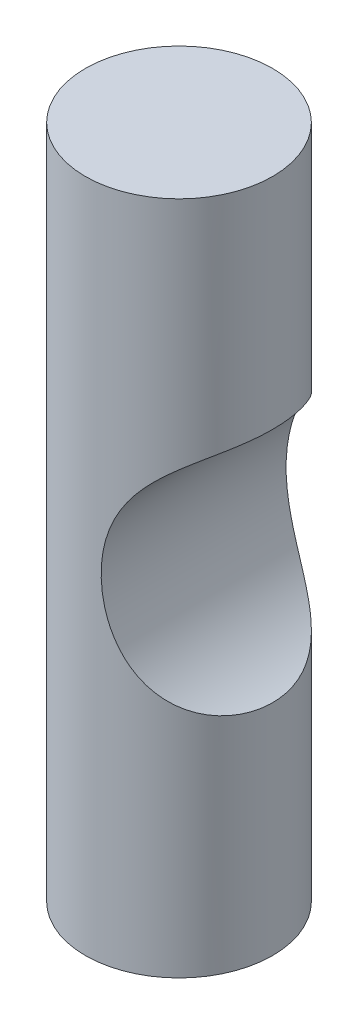
ISO-10303-21;
HEADER;
FILE_DESCRIPTION(('STEP AP214'),'2;1');
FILE_NAME('part.step','',(''),(''),'','','');
FILE_SCHEMA(('AUTOMOTIVE_DESIGN { 1 0 10303 214 1 1 1 1 }'));
ENDSEC;
DATA;
#1=APPLICATION_CONTEXT('core data for automotive mechanical design processes');
#2=APPLICATION_PROTOCOL_DEFINITION('international standard','automotive_design',2000,#1);
#3=PRODUCT_CONTEXT('',#1,'mechanical');
#4=PRODUCT('Part','Part','',(#3));
#5=PRODUCT_RELATED_PRODUCT_CATEGORY('part','',(#4));
#6=PRODUCT_DEFINITION_FORMATION('','',#4);
#7=PRODUCT_DEFINITION_CONTEXT('part definition',#1,'design');
#8=PRODUCT_DEFINITION('design','',#6,#7);
#9=PRODUCT_DEFINITION_SHAPE('','',#8);
#10=(LENGTH_UNIT() NAMED_UNIT(*) SI_UNIT(.MILLI.,.METRE.));
#11=(NAMED_UNIT(*) PLANE_ANGLE_UNIT() SI_UNIT($,.RADIAN.));
#12=(NAMED_UNIT(*) SI_UNIT($,.STERADIAN.) SOLID_ANGLE_UNIT());
#13=UNCERTAINTY_MEASURE_WITH_UNIT(LENGTH_MEASURE(1.E-05),#10,'distance_accuracy_value','');
#14=(GEOMETRIC_REPRESENTATION_CONTEXT(3) GLOBAL_UNCERTAINTY_ASSIGNED_CONTEXT((#13)) GLOBAL_UNIT_ASSIGNED_CONTEXT((#10,
#11,#12)) REPRESENTATION_CONTEXT('',''));
#15=CARTESIAN_POINT('',(0.,0.,0.));
#16=DIRECTION('',(0.,0.,1.));
#17=DIRECTION('',(1.,0.,0.));
#18=AXIS2_PLACEMENT_3D('',#15,#16,#17);
#19=CARTESIAN_POINT('',(0.,28.83,0.));
#20=DIRECTION('',(0.,-1.,0.));
#21=DIRECTION('',(0.,0.,-1.));
#22=AXIS2_PLACEMENT_3D('',#19,#20,#21);
#23=CYLINDRICAL_SURFACE('',#22,4.);
#24=CARTESIAN_POINT('',(4.,19.471246137205,0.));
#25=CARTESIAN_POINT('',(3.99999258356673,19.4712505246636,-0.203653398195238));
#26=CARTESIAN_POINT('',(3.98436735498648,19.4648400834942,-0.4076149875149));
#27=CARTESIAN_POINT('',(3.92238665519655,19.4384185122939,-0.810269058888529));
#28=CARTESIAN_POINT('',(3.87595757201813,19.4183747999379,-1.00894773058148));
#29=CARTESIAN_POINT('',(3.7542698941072,19.3624884274466,-1.39513811787545));
#30=CARTESIAN_POINT('',(3.67899604930116,19.3266374085589,-1.58264386571384));
#31=CARTESIAN_POINT('',(3.50345839484383,19.2361287302331,-1.94047240204014));
#32=CARTESIAN_POINT('',(3.40321866163089,19.1814891707513,-2.11081152454106));
#33=CARTESIAN_POINT('',(3.18637384314542,19.0520123834663,-2.42540867912362));
#34=CARTESIAN_POINT('',(3.07023745384192,18.9777109341157,-2.57020973433506));
#35=CARTESIAN_POINT('',(2.82719239079111,18.8066237403505,-2.83537267866698));
#36=CARTESIAN_POINT('',(2.7002854494201,18.7098416074809,-2.95573848752046));
#37=CARTESIAN_POINT('',(2.44719023826217,18.496578819836,-3.16827229222424));
#38=CARTESIAN_POINT('',(2.32106163005266,18.3806437119212,-3.26106329240897));
#39=CARTESIAN_POINT('',(2.07367213235101,18.1292208033843,-3.42371906714664));
#40=CARTESIAN_POINT('',(1.95241307626148,17.9937257249713,-3.49357527640201));
#41=CARTESIAN_POINT('',(1.71133415433201,17.6944888486006,-3.61818056384484));
#42=CARTESIAN_POINT('',(1.59240171601037,17.5293556739364,-3.67127874376062));
#43=CARTESIAN_POINT('',(1.3719727845895,17.183307131983,-3.75923159383499));
#44=CARTESIAN_POINT('',(1.27048713539856,17.0023820539272,-3.79407494520135));
#45=CARTESIAN_POINT('',(1.12527330768508,16.7047547088348,-3.83887162778612));
#46=CARTESIAN_POINT('',(1.07484683676463,16.5918771375409,-3.85318370995402));
#47=CARTESIAN_POINT('',(0.981615739023421,16.3625802231677,-3.87798448613677));
#48=CARTESIAN_POINT('',(0.938811863351047,16.2461605323617,-3.88847280345541));
#49=CARTESIAN_POINT('',(0.861138979758897,16.0104234146592,-3.90640865690444));
#50=CARTESIAN_POINT('',(0.826273768143512,15.8911046314609,-3.91385473957103));
#51=CARTESIAN_POINT('',(0.764718093305174,15.650250438669,-3.92634582530793));
#52=CARTESIAN_POINT('',(0.738028174287198,15.5287148820819,-3.93139066854722));
#53=CARTESIAN_POINT('',(0.689334605250426,15.2642398762848,-3.94024519349803));
#54=CARTESIAN_POINT('',(0.668787929447591,15.1210190047184,-3.94372295287833));
#55=CARTESIAN_POINT('',(0.639092166341393,14.8333581531511,-3.94864359050172));
#56=CARTESIAN_POINT('',(0.629944225022524,14.6889180520431,-3.95008626414713));
#57=CARTESIAN_POINT('',(0.623109652174249,14.3996754317851,-3.95117034464512));
#58=CARTESIAN_POINT('',(0.62542962219884,14.2548727518587,-3.95081071399159));
#59=CARTESIAN_POINT('',(0.641529987226555,13.9659246397631,-3.94822804702878));
#60=CARTESIAN_POINT('',(0.655310328606892,13.8217792045218,-3.9460050194383));
#61=CARTESIAN_POINT('',(0.69519286512679,13.5280284651581,-3.93917997059751));
#62=CARTESIAN_POINT('',(0.721867350039431,13.3785029921998,-3.93446639987842));
#63=CARTESIAN_POINT('',(0.787512357402782,13.0822908622137,-3.92185417011357));
#64=CARTESIAN_POINT('',(0.826484217056448,12.9356045157514,-3.91395516466118));
#65=CARTESIAN_POINT('',(0.916344210754707,12.6463094759536,-3.89389659319605));
#66=CARTESIAN_POINT('',(0.967225687133969,12.5036985541879,-3.88173940569683));
#67=CARTESIAN_POINT('',(1.0803798717014,12.2236940896224,-3.8517792939948));
#68=CARTESIAN_POINT('',(1.14264971436529,12.0862992448392,-3.83397778918212));
#69=CARTESIAN_POINT('',(1.26350129094669,11.846352250641,-3.79561365182164));
#70=CARTESIAN_POINT('',(1.32008510507233,11.7425691376272,-3.77642788364627));
#71=CARTESIAN_POINT('',(1.43928466803319,11.5397285521709,-3.73262521638724));
#72=CARTESIAN_POINT('',(1.50189913871912,11.440670085003,-3.7080094667238));
#73=CARTESIAN_POINT('',(1.6323941532934,11.2480383639749,-3.65243926881132));
#74=CARTESIAN_POINT('',(1.70027091783214,11.1544612566927,-3.62148934400862));
#75=CARTESIAN_POINT('',(1.84038544833741,10.9734295356641,-3.55233477556728));
#76=CARTESIAN_POINT('',(1.9126232667104,10.8859749955194,-3.51413004473634));
#77=CARTESIAN_POINT('',(2.06097006110533,10.7170799828172,-3.42925217466383));
#78=CARTESIAN_POINT('',(2.13710928118382,10.6357044983499,-3.38250207218027));
#79=CARTESIAN_POINT('',(2.29113810652205,10.480518130368,-3.28012691916216));
#80=CARTESIAN_POINT('',(2.36902771924204,10.4067072791017,-3.22450183079589));
#81=CARTESIAN_POINT('',(2.52479863550713,10.2671706847812,-3.10404173152522));
#82=CARTESIAN_POINT('',(2.60267989783557,10.2014386584795,-3.03921396359726));
#83=CARTESIAN_POINT('',(2.75666527008035,10.0782431325558,-2.90026575924399));
#84=CARTESIAN_POINT('',(2.83276968609156,10.0207781998362,-2.82614693759812));
#85=CARTESIAN_POINT('',(2.96994679833736,9.92229557286796,-2.68100794869534));
#86=CARTESIAN_POINT('',(3.03153257043186,9.88010738939464,-2.61126114159875));
#87=CARTESIAN_POINT('',(3.15107453454678,9.80147838993331,-2.4656837454922));
#88=CARTESIAN_POINT('',(3.20903092784026,9.76503725506297,-2.38985349438237));
#89=CARTESIAN_POINT('',(3.3203632129503,9.69764033188429,-2.23259306069193));
#90=CARTESIAN_POINT('',(3.37373871561842,9.66668500936044,-2.15116240341102));
#91=CARTESIAN_POINT('',(3.47507685686352,9.60992160271381,-1.98329345608763));
#92=CARTESIAN_POINT('',(3.52303944734038,9.58411356432917,-1.89685512155636));
#93=CARTESIAN_POINT('',(3.6107797116522,9.53834724824622,-1.72373116980304));
#94=CARTESIAN_POINT('',(3.65083335339182,9.51817361443437,-1.63724190947188));
#95=CARTESIAN_POINT('',(3.72491493686805,9.48181644440333,-1.46087641617268));
#96=CARTESIAN_POINT('',(3.75894092189137,9.46563420321378,-1.37099909480474));
#97=CARTESIAN_POINT('',(3.82055973449153,9.43695496468755,-1.18852621302643));
#98=CARTESIAN_POINT('',(3.84815446631996,9.4244568762066,-1.09593146639388));
#99=CARTESIAN_POINT('',(3.89664518799093,9.40285898996741,-0.908583017548995));
#100=CARTESIAN_POINT('',(3.91753878581004,9.39376040549859,-0.813828557307844));
#101=CARTESIAN_POINT('',(3.9530971796969,9.37845118343353,-0.619037145864924));
#102=CARTESIAN_POINT('',(3.96748377467427,9.37236861631275,-0.518939255333288));
#103=CARTESIAN_POINT('',(3.98863793103614,9.36347480549814,-0.317796906170506));
#104=CARTESIAN_POINT('',(3.99540529982337,9.3606636444982,-0.216752423676695));
#105=CARTESIAN_POINT('',(4.00125558110762,9.35823155651616,-0.0143639036439383));
#106=CARTESIAN_POINT('',(4.00033554582006,9.35861185331936,0.0869802339077602));
#107=CARTESIAN_POINT('',(3.99081463884081,9.36257598931308,0.289209515012648));
#108=CARTESIAN_POINT('',(3.98221635751152,9.36615874810919,0.390094801829622));
#109=CARTESIAN_POINT('',(3.9571210932654,9.3767576904249,0.593229659061676));
#110=CARTESIAN_POINT('',(3.9404347772976,9.38385626753314,0.695451629083218));
#111=CARTESIAN_POINT('',(3.89927639582057,9.40172332369736,0.897949991293142));
#112=CARTESIAN_POINT('',(3.87480729666801,9.41249040463838,0.99822710932459));
#113=CARTESIAN_POINT('',(3.81834894168069,9.43798759669077,1.1961628050183));
#114=CARTESIAN_POINT('',(3.78635732059267,9.45271895447248,1.29382054830778));
#115=CARTESIAN_POINT('',(3.71526097520503,9.48649192810439,1.48569792562022));
#116=CARTESIAN_POINT('',(3.67615927551235,9.50553171200124,1.57991900120767));
#117=CARTESIAN_POINT('',(3.59196361971271,9.54801245019084,1.76289295166191));
#118=CARTESIAN_POINT('',(3.54696476121915,9.57138559220897,1.85170530114381));
#119=CARTESIAN_POINT('',(3.45119377507423,9.62308923311731,2.02460442634021));
#120=CARTESIAN_POINT('',(3.40042402587428,9.65141769226738,2.108693127691));
#121=CARTESIAN_POINT('',(3.29387518946345,9.71339562856492,2.27153038447647));
#122=CARTESIAN_POINT('',(3.23809766513262,9.74704344806655,2.35028059263203));
#123=CARTESIAN_POINT('',(3.12241560365351,9.81997135719328,2.50192209870033));
#124=CARTESIAN_POINT('',(3.06251123013784,9.85925122357025,2.57481362866597));
#125=CARTESIAN_POINT('',(2.94215794635978,9.94188473692225,2.71139134557764));
#126=CARTESIAN_POINT('',(2.88183669695433,9.98499916129331,2.77533508663677));
#127=CARTESIAN_POINT('',(2.75926497613144,10.0766855650251,2.89722799504157));
#128=CARTESIAN_POINT('',(2.69701386911246,10.1252593565672,2.95517515955237));
#129=CARTESIAN_POINT('',(2.57160787558026,10.2278016036688,3.06492657639825));
#130=CARTESIAN_POINT('',(2.50845332025306,10.2817681236907,3.11673301824689));
#131=CARTESIAN_POINT('',(2.38216110481709,10.39498819542,3.21429300831172));
#132=CARTESIAN_POINT('',(2.31902346032057,10.4542437542641,3.26004424214502));
#133=CARTESIAN_POINT('',(2.19311401258475,10.5783675594138,3.3460602032039));
#134=CARTESIAN_POINT('',(2.13035109115736,10.6432829334661,3.38626987192536));
#135=CARTESIAN_POINT('',(2.00662413226691,10.7779296173199,3.46102419254773));
#136=CARTESIAN_POINT('',(1.94566074841118,10.8476626469491,3.49556680639288));
#137=CARTESIAN_POINT('',(1.76661811628854,11.0635441359097,3.59129140887186));
#138=CARTESIAN_POINT('',(1.65233109200647,11.2164287813395,3.64460637638809));
#139=CARTESIAN_POINT('',(1.42439417787222,11.5580748628341,3.74010877595796));
#140=CARTESIAN_POINT('',(1.31286133876627,11.7489018697993,3.77986444602482));
#141=CARTESIAN_POINT('',(1.11287987560218,12.1448682701168,3.84350617480728));
#142=CARTESIAN_POINT('',(1.02444731868112,12.3500175001088,3.86738120567977));
#143=CARTESIAN_POINT('',(0.903559969152102,12.6856902987869,3.89688443400019));
#144=CARTESIAN_POINT('',(0.862895469495691,12.8130467224661,3.90598941332577));
#145=CARTESIAN_POINT('',(0.790946354421803,13.0705915004719,3.92119444960242));
#146=CARTESIAN_POINT('',(0.759662731675673,13.2007801529386,3.92729418858701));
#147=CARTESIAN_POINT('',(0.706700211092576,13.4632245721041,3.9371689029978));
#148=CARTESIAN_POINT('',(0.685024831485622,13.5954810776629,3.94094302705552));
#149=CARTESIAN_POINT('',(0.65142691361461,13.8612675566077,3.9466356085593));
#150=CARTESIAN_POINT('',(0.639504668246624,13.9947975681166,3.94855401027654));
#151=CARTESIAN_POINT('',(0.624688751246172,14.277647941954,3.95092805381675));
#152=CARTESIAN_POINT('',(0.622979087687296,14.4270332862843,3.95119204033199));
#153=CARTESIAN_POINT('',(0.631770434509151,14.7254445867963,3.94979546987619));
#154=CARTESIAN_POINT('',(0.642272497746485,14.8744705108799,3.94813474696281));
#155=CARTESIAN_POINT('',(0.675424287221765,15.1712501595291,3.94259875401674));
#156=CARTESIAN_POINT('',(0.698083927131941,15.3190027457292,3.93872167652933));
#157=CARTESIAN_POINT('',(0.755380878989017,15.6120639659134,3.92813538697106));
#158=CARTESIAN_POINT('',(0.790017912631836,15.7573726566011,3.92142624070472));
#159=CARTESIAN_POINT('',(0.871574414695249,16.0465924507113,3.90411599743935));
#160=CARTESIAN_POINT('',(0.918667125774038,16.1904515214286,3.89345908095025));
#161=CARTESIAN_POINT('',(1.02442696397773,16.473395260512,3.86697810764188));
#162=CARTESIAN_POINT('',(1.08309544540029,16.6124793679979,3.85115344608451));
#163=CARTESIAN_POINT('',(1.21120109440219,16.8843759993487,3.81280136863109));
#164=CARTESIAN_POINT('',(1.28062083711997,17.0171982254988,3.79028474524989));
#165=CARTESIAN_POINT('',(1.42926559033637,17.2754242585812,3.736767504407));
#166=CARTESIAN_POINT('',(1.50848641447385,17.4008311992263,3.70577050238482));
#167=CARTESIAN_POINT('',(1.65165299242729,17.6085806974101,3.64366373223664));
#168=CARTESIAN_POINT('',(1.71358405091103,17.6930735322354,3.61506410876957));
#169=CARTESIAN_POINT('',(1.84099227460926,17.8569822334399,3.55187297416359));
#170=CARTESIAN_POINT('',(1.90646854834898,17.9363993652969,3.51728296459311));
#171=CARTESIAN_POINT('',(2.04003872532889,18.0895965922543,3.44153017745602));
#172=CARTESIAN_POINT('',(2.10813057214611,18.1633809848993,3.40037248637067));
#173=CARTESIAN_POINT('',(2.24592901443933,18.3049250465019,3.31097351262348));
#174=CARTESIAN_POINT('',(2.31563564514919,18.3726845838435,3.26273207527467));
#175=CARTESIAN_POINT('',(2.45590103614191,18.5022164773924,3.15851686564734));
#176=CARTESIAN_POINT('',(2.52646239913195,18.5639487023711,3.10249658344258));
#177=CARTESIAN_POINT('',(2.66667910716934,18.6807072056535,2.98283671035975));
#178=CARTESIAN_POINT('',(2.73633444606289,18.7357334384307,2.91919706776012));
#179=CARTESIAN_POINT('',(2.87336542656734,18.8390046497289,2.7844217255531));
#180=CARTESIAN_POINT('',(2.94074135743641,18.8872504911547,2.71328698182783));
#181=CARTESIAN_POINT('',(3.0718929408088,18.9770732619492,2.56385512318855));
#182=CARTESIAN_POINT('',(3.13566886872367,19.0186507019208,2.48555855738063));
#183=CARTESIAN_POINT('',(3.25221661521849,19.0915366401949,2.33056268709925));
#184=CARTESIAN_POINT('',(3.30544984976396,19.1234575833444,2.25449633976287));
#185=CARTESIAN_POINT('',(3.40725646770001,19.182412194417,2.09746573461653));
#186=CARTESIAN_POINT('',(3.45582822147184,19.209444156089,2.01649977995323));
#187=CARTESIAN_POINT('',(3.54763042975883,19.2589404605793,1.85022582772317));
#188=CARTESIAN_POINT('',(3.59085945105676,19.2814035788192,1.76491667369745));
#189=CARTESIAN_POINT('',(3.67141882408767,19.3221016349741,1.59057349414591));
#190=CARTESIAN_POINT('',(3.70874709842868,19.3403350848614,1.5015381706909));
#191=CARTESIAN_POINT('',(3.81150587450231,19.3893622475902,1.2288921108176));
#192=CARTESIAN_POINT('',(3.86730639514349,19.4142754141606,1.04046738133549));
#193=CARTESIAN_POINT('',(3.95061300900662,19.4506570507214,0.656629045748421));
#194=CARTESIAN_POINT('',(3.97818003286681,19.4621544806865,0.461231435598617));
#195=CARTESIAN_POINT('',(3.99414321311536,19.4688092470787,0.220866751801535));
#196=CARTESIAN_POINT('',(3.99633809720005,19.4697239914759,0.176730172435416));
#197=CARTESIAN_POINT('',(3.99926730136634,19.4709419627576,0.0884005697106248));
#198=CARTESIAN_POINT('',(4.00000160990348,19.4712451848085,0.0442075459085753));
#199=CARTESIAN_POINT('',(4.,19.471246137205,0.));
#200=B_SPLINE_CURVE_WITH_KNOTS('',3,(#24,#25,#26,#27,#28,#29,#30,#31,#32,#33,#34,#35,#36,#37,
#38,#39,#40,#41,#42,#43,#44,#45,#46,#47,#48,#49,#50,#51,#52,#53,#54,#55,#56,#57,#58,#59,#60,#61,
#62,#63,#64,#65,#66,#67,#68,#69,#70,#71,#72,#73,#74,#75,#76,#77,#78,#79,#80,#81,#82,#83,#84,#85,
#86,#87,#88,#89,#90,#91,#92,#93,#94,#95,#96,#97,#98,#99,#100,#101,#102,#103,#104,#105,#106,#107,
#108,#109,#110,#111,#112,#113,#114,#115,#116,#117,#118,#119,#120,#121,#122,#123,#124,#125,#126,
#127,#128,#129,#130,#131,#132,#133,#134,#135,#136,#137,#138,#139,#140,#141,#142,#143,#144,#145,
#146,#147,#148,#149,#150,#151,#152,#153,#154,#155,#156,#157,#158,#159,#160,#161,#162,#163,#164,
#165,#166,#167,#168,#169,#170,#171,#172,#173,#174,#175,#176,#177,#178,#179,#180,#181,#182,#183,
#184,#185,#186,#187,#188,#189,#190,#191,#192,#193,#194,#195,#196,#197,#198,#199),.UNSPECIFIED.,
.T.,.F.,(4,2,2,2,2,2,2,2,2,2,2,2,2,2,2,2,2,2,2,2,2,2,2,2,2,2,2,2,2,2,2,2,2,2,2,2,2,2,2,2,2,2,2,
2,2,2,2,2,2,2,2,2,2,2,2,2,2,2,2,2,2,2,2,2,2,2,2,2,2,2,2,2,2,2,2,2,2,2,2,2,2,2,2,2,2,2,2,4),(0.,
0.610795557039799,1.22305601498511,1.83564061941311,2.44763673561139,3.04442140336521,
3.64111026327821,4.22306218663669,4.80523120097816,5.43386843448786,6.06289499065008,
6.43595833007477,6.80905841171619,7.18233653850387,7.55563950791181,7.98934329273686,
8.42309067693881,8.85708777881276,9.29108285003671,9.74640720174261,10.2017810819878,
10.6569010063992,11.1119065713529,11.4708295567022,11.8296766379025,12.1882683430467,
12.5468643582192,12.9088652449913,13.2708676749179,13.6325867541304,13.9942430537251,
14.3003373443289,14.6064146449201,14.9125179212127,15.2186239173805,15.5105716546533,
15.8026139917643,16.094569746897,16.3866296022833,16.6902096655565,16.9937974024936,
17.2975015574439,17.6011032922929,17.9121829029953,18.2231440895422,18.5342031804602,
18.8451302559938,19.1515493792221,19.4578426677401,19.7640406950702,20.0702265884017,
20.3636011292157,20.657073341941,20.9504405985029,21.2439196621854,21.5401316451395,
21.8364499230634,22.4288334624395,23.1002077596714,23.7720477876732,24.1737060629264,
24.5754068261131,24.9772545579582,25.3791143572371,25.8267796451238,26.2744835321629,
26.7225530471829,27.1706121516578,27.625264709596,28.0799704908069,28.5339468846959,
28.9877300356362,29.3132027780189,29.6385940541851,29.9637345364028,30.2888821197323,
30.6160649433737,30.9432499881154,31.270393355948,31.5975116622688,31.8916929452912,
32.1859767000921,32.4803392275603,32.7748051573549,33.3662744537613,33.9564645948228,
34.0890504463093,34.2216373457565),.UNSPECIFIED.);
#201=CARTESIAN_POINT('',(4.,19.471246137205,0.));
#202=VERTEX_POINT('',#201);
#203=EDGE_CURVE('E37',#202,#202,#200,.T.);
#204=ORIENTED_EDGE('',*,*,#203,.T.);
#205=EDGE_LOOP('',(#204));
#206=FACE_BOUND('',#205,.T.);
#207=CARTESIAN_POINT('',(0.,28.83,0.));
#208=DIRECTION('',(0.,1.,0.));
#209=DIRECTION('',(0.,0.,1.));
#210=AXIS2_PLACEMENT_3D('',#207,#208,#209);
#211=CIRCLE('',#210,4.);
#212=CARTESIAN_POINT('',(0.,28.83,4.));
#213=VERTEX_POINT('',#212);
#214=EDGE_CURVE('E45',#213,#213,#211,.T.);
#215=ORIENTED_EDGE('',*,*,#214,.F.);
#216=EDGE_LOOP('',(#215));
#217=FACE_BOUND('',#216,.T.);
#218=CARTESIAN_POINT('',(0.,0.,0.));
#219=DIRECTION('',(0.,1.,0.));
#220=DIRECTION('',(0.,0.,1.));
#221=AXIS2_PLACEMENT_3D('',#218,#219,#220);
#222=CIRCLE('',#221,4.);
#223=CARTESIAN_POINT('',(0.,0.,4.));
#224=VERTEX_POINT('',#223);
#225=EDGE_CURVE('E50',#224,#224,#222,.T.);
#226=ORIENTED_EDGE('',*,*,#225,.T.);
#227=EDGE_LOOP('',(#226));
#228=FACE_BOUND('',#227,.T.);
#229=ADVANCED_FACE('F33',(#206,#217,#228),#23,.T.);
#230=CARTESIAN_POINT('',(0.,28.83,0.));
#231=DIRECTION('',(0.,1.,0.));
#232=DIRECTION('',(0.,0.,1.));
#233=AXIS2_PLACEMENT_3D('',#230,#231,#232);
#234=PLANE('',#233);
#235=ORIENTED_EDGE('',*,*,#214,.T.);
#236=EDGE_LOOP('',(#235));
#237=FACE_BOUND('',#236,.T.);
#238=ADVANCED_FACE('F77',(#237),#234,.T.);
#239=CARTESIAN_POINT('',(0.,0.,0.));
#240=DIRECTION('',(0.,1.,0.));
#241=DIRECTION('',(0.,0.,1.));
#242=AXIS2_PLACEMENT_3D('',#239,#240,#241);
#243=PLANE('',#242);
#244=CARTESIAN_POINT('',(0.,0.,0.0697640563936423));
#245=DIRECTION('',(0.,-1.,0.));
#246=DIRECTION('',(0.,0.,-1.));
#247=AXIS2_PLACEMENT_3D('',#244,#245,#246);
#248=CIRCLE('',#247,2.5);
#249=CARTESIAN_POINT('',(0.,0.,-2.43023594360636));
#250=VERTEX_POINT('',#249);
#251=EDGE_CURVE('E10',#250,#250,#248,.T.);
#252=ORIENTED_EDGE('',*,*,#251,.F.);
#253=EDGE_LOOP('',(#252));
#254=FACE_BOUND('',#253,.T.);
#255=ORIENTED_EDGE('',*,*,#225,.F.);
#256=EDGE_LOOP('',(#255));
#257=FACE_BOUND('',#256,.T.);
#258=ADVANCED_FACE('F74',(#254,#257),#243,.F.);
#259=CARTESIAN_POINT('',(6.1,14.415,-4.));
#260=DIRECTION('',(0.,0.,1.));
#261=DIRECTION('',(1.,0.,0.));
#262=AXIS2_PLACEMENT_3D('',#259,#260,#261);
#263=CYLINDRICAL_SURFACE('',#262,5.475);
#264=ORIENTED_EDGE('',*,*,#203,.F.);
#265=EDGE_LOOP('',(#264));
#266=FACE_BOUND('',#265,.T.);
#267=ADVANCED_FACE('F67',(#266),#263,.F.);
#268=CARTESIAN_POINT('',(0.,-1.,0.0697640563936423));
#269=DIRECTION('',(0.,1.,0.));
#270=DIRECTION('',(0.,0.,1.));
#271=AXIS2_PLACEMENT_3D('',#268,#269,#270);
#272=CYLINDRICAL_SURFACE('',#271,2.5);
#273=CARTESIAN_POINT('',(0.,-1.,0.0697640563936423));
#274=DIRECTION('',(0.,-1.,0.));
#275=DIRECTION('',(0.,0.,-1.));
#276=AXIS2_PLACEMENT_3D('',#273,#274,#275);
#277=CIRCLE('',#276,2.5);
#278=CARTESIAN_POINT('',(0.,-1.,-2.43023594360636));
#279=VERTEX_POINT('',#278);
#280=EDGE_CURVE('E53',#279,#279,#277,.T.);
#281=ORIENTED_EDGE('',*,*,#280,.F.);
#282=EDGE_LOOP('',(#281));
#283=FACE_BOUND('',#282,.T.);
#284=ORIENTED_EDGE('',*,*,#251,.T.);
#285=EDGE_LOOP('',(#284));
#286=FACE_BOUND('',#285,.T.);
#287=ADVANCED_FACE('F65',(#283,#286),#272,.T.);
#288=CARTESIAN_POINT('',(0.,-1.,0.0697640563936423));
#289=DIRECTION('',(0.,-1.,0.));
#290=DIRECTION('',(0.,0.,-1.));
#291=AXIS2_PLACEMENT_3D('',#288,#289,#290);
#292=PLANE('',#291);
#293=ORIENTED_EDGE('',*,*,#280,.T.);
#294=EDGE_LOOP('',(#293));
#295=FACE_BOUND('',#294,.T.);
#296=ADVANCED_FACE('F63',(#295),#292,.T.);
#297=CLOSED_SHELL('',(#229,#238,#258,#267,#287,#296));
#298=MANIFOLD_SOLID_BREP('B2',#297);
#299=ADVANCED_BREP_SHAPE_REPRESENTATION('',(#18,#298),#14);
#300=SHAPE_DEFINITION_REPRESENTATION(#9,#299);
ENDSEC;
END-ISO-10303-21;
